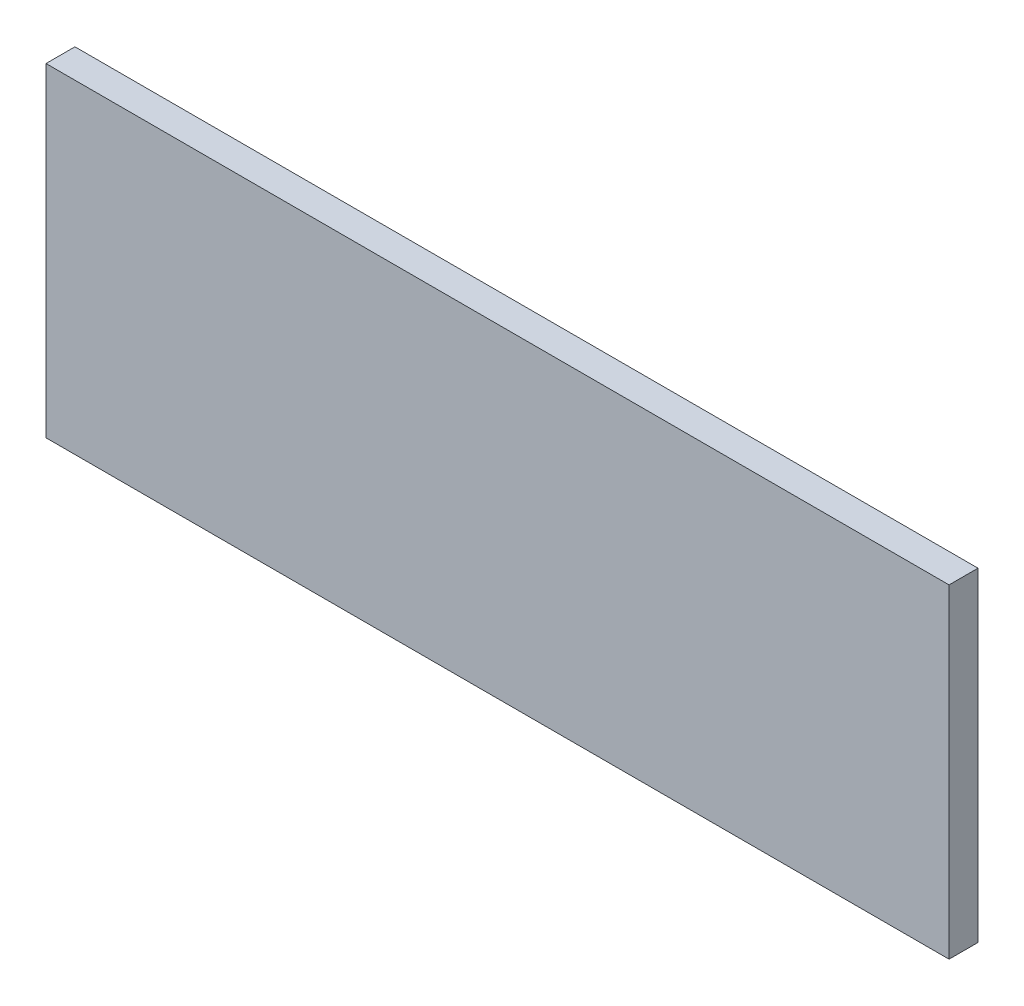
ISO-10303-21;
HEADER;
FILE_DESCRIPTION(('STEP AP214'),'2;1');
FILE_NAME('part.step','',(''),(''),'','','');
FILE_SCHEMA(('AUTOMOTIVE_DESIGN { 1 0 10303 214 1 1 1 1 }'));
ENDSEC;
DATA;
#1=APPLICATION_CONTEXT('core data for automotive mechanical design processes');
#2=APPLICATION_PROTOCOL_DEFINITION('international standard','automotive_design',2000,#1);
#3=PRODUCT_CONTEXT('',#1,'mechanical');
#4=PRODUCT('Part','Part','',(#3));
#5=PRODUCT_RELATED_PRODUCT_CATEGORY('part','',(#4));
#6=PRODUCT_DEFINITION_FORMATION('','',#4);
#7=PRODUCT_DEFINITION_CONTEXT('part definition',#1,'design');
#8=PRODUCT_DEFINITION('design','',#6,#7);
#9=PRODUCT_DEFINITION_SHAPE('','',#8);
#10=(LENGTH_UNIT() NAMED_UNIT(*) SI_UNIT(.MILLI.,.METRE.));
#11=(NAMED_UNIT(*) PLANE_ANGLE_UNIT() SI_UNIT($,.RADIAN.));
#12=(NAMED_UNIT(*) SI_UNIT($,.STERADIAN.) SOLID_ANGLE_UNIT());
#13=UNCERTAINTY_MEASURE_WITH_UNIT(LENGTH_MEASURE(1.E-05),#10,'distance_accuracy_value','');
#14=(GEOMETRIC_REPRESENTATION_CONTEXT(3) GLOBAL_UNCERTAINTY_ASSIGNED_CONTEXT((#13)) GLOBAL_UNIT_ASSIGNED_CONTEXT((#10,
#11,#12)) REPRESENTATION_CONTEXT('',''));
#15=CARTESIAN_POINT('',(0.,0.,0.));
#16=DIRECTION('',(0.,0.,1.));
#17=DIRECTION('',(1.,0.,0.));
#18=AXIS2_PLACEMENT_3D('',#15,#16,#17);
#19=CARTESIAN_POINT('',(-36.1150442477876,16.9218289085546,2.5));
#20=DIRECTION('',(1.,0.,0.));
#21=DIRECTION('',(0.,1.,0.));
#22=AXIS2_PLACEMENT_3D('',#19,#20,#21);
#23=PLANE('',#22);
#24=DIRECTION('',(0.,-1.,0.));
#25=VECTOR('',#24,1.);
#26=CARTESIAN_POINT('',(-36.1150442477876,16.9218289085546,0.));
#27=LINE('',#26,#25);
#28=CARTESIAN_POINT('',(-36.1150442477876,16.9218289085546,0.));
#29=VERTEX_POINT('',#28);
#30=CARTESIAN_POINT('',(-36.1150442477876,-11.0781710914454,0.));
#31=VERTEX_POINT('',#30);
#32=EDGE_CURVE('E96',#29,#31,#27,.T.);
#33=ORIENTED_EDGE('',*,*,#32,.T.);
#34=DIRECTION('',(0.,0.,-1.));
#35=VECTOR('',#34,1.);
#36=CARTESIAN_POINT('',(-36.1150442477876,-11.0781710914454,2.5));
#37=LINE('',#36,#35);
#38=CARTESIAN_POINT('',(-36.1150442477876,-11.0781710914454,2.5));
#39=VERTEX_POINT('',#38);
#40=EDGE_CURVE('E11',#39,#31,#37,.T.);
#41=ORIENTED_EDGE('',*,*,#40,.F.);
#42=DIRECTION('',(0.,-1.,0.));
#43=VECTOR('',#42,1.);
#44=CARTESIAN_POINT('',(-36.1150442477876,16.9218289085546,2.5));
#45=LINE('',#44,#43);
#46=CARTESIAN_POINT('',(-36.1150442477876,16.9218289085546,2.5));
#47=VERTEX_POINT('',#46);
#48=EDGE_CURVE('E84',#47,#39,#45,.T.);
#49=ORIENTED_EDGE('',*,*,#48,.F.);
#50=DIRECTION('',(0.,0.,-1.));
#51=VECTOR('',#50,1.);
#52=CARTESIAN_POINT('',(-36.1150442477876,16.9218289085546,2.5));
#53=LINE('',#52,#51);
#54=EDGE_CURVE('E92',#47,#29,#53,.T.);
#55=ORIENTED_EDGE('',*,*,#54,.T.);
#56=EDGE_LOOP('',(#33,#41,#49,#55));
#57=FACE_BOUND('',#56,.T.);
#58=ADVANCED_FACE('F33',(#57),#23,.F.);
#59=CARTESIAN_POINT('',(41.8849557522124,-11.0781710914454,2.5));
#60=DIRECTION('',(0.,1.,0.));
#61=DIRECTION('',(-1.,0.,0.));
#62=AXIS2_PLACEMENT_3D('',#59,#60,#61);
#63=PLANE('',#62);
#64=DIRECTION('',(1.,0.,0.));
#65=VECTOR('',#64,1.);
#66=CARTESIAN_POINT('',(41.8849557522124,-11.0781710914454,0.));
#67=LINE('',#66,#65);
#68=CARTESIAN_POINT('',(41.8849557522124,-11.0781710914454,0.));
#69=VERTEX_POINT('',#68);
#70=EDGE_CURVE('E88',#31,#69,#67,.T.);
#71=ORIENTED_EDGE('',*,*,#70,.T.);
#72=DIRECTION('',(0.,0.,-1.));
#73=VECTOR('',#72,1.);
#74=CARTESIAN_POINT('',(41.8849557522124,-11.0781710914454,2.5));
#75=LINE('',#74,#73);
#76=CARTESIAN_POINT('',(41.8849557522124,-11.0781710914454,2.5));
#77=VERTEX_POINT('',#76);
#78=EDGE_CURVE('E41',#77,#69,#75,.T.);
#79=ORIENTED_EDGE('',*,*,#78,.F.);
#80=DIRECTION('',(1.,0.,0.));
#81=VECTOR('',#80,1.);
#82=CARTESIAN_POINT('',(41.8849557522124,-11.0781710914454,2.5));
#83=LINE('',#82,#81);
#84=EDGE_CURVE('E79',#39,#77,#83,.T.);
#85=ORIENTED_EDGE('',*,*,#84,.F.);
#86=ORIENTED_EDGE('',*,*,#40,.T.);
#87=EDGE_LOOP('',(#71,#79,#85,#86));
#88=FACE_BOUND('',#87,.T.);
#89=ADVANCED_FACE('F87',(#88),#63,.F.);
#90=CARTESIAN_POINT('',(41.8849557522124,16.9218289085546,2.5));
#91=DIRECTION('',(-1.,0.,0.));
#92=DIRECTION('',(0.,0.,1.));
#93=AXIS2_PLACEMENT_3D('',#90,#91,#92);
#94=PLANE('',#93);
#95=DIRECTION('',(0.,1.,0.));
#96=VECTOR('',#95,1.);
#97=CARTESIAN_POINT('',(41.8849557522124,16.9218289085546,0.));
#98=LINE('',#97,#96);
#99=CARTESIAN_POINT('',(41.8849557522124,16.9218289085546,0.));
#100=VERTEX_POINT('',#99);
#101=EDGE_CURVE('E66',#69,#100,#98,.T.);
#102=ORIENTED_EDGE('',*,*,#101,.T.);
#103=DIRECTION('',(0.,0.,-1.));
#104=VECTOR('',#103,1.);
#105=CARTESIAN_POINT('',(41.8849557522124,16.9218289085546,2.5));
#106=LINE('',#105,#104);
#107=CARTESIAN_POINT('',(41.8849557522124,16.9218289085546,2.5));
#108=VERTEX_POINT('',#107);
#109=EDGE_CURVE('E89',#108,#100,#106,.T.);
#110=ORIENTED_EDGE('',*,*,#109,.F.);
#111=DIRECTION('',(0.,1.,0.));
#112=VECTOR('',#111,1.);
#113=CARTESIAN_POINT('',(41.8849557522124,16.9218289085546,2.5));
#114=LINE('',#113,#112);
#115=EDGE_CURVE('E82',#77,#108,#114,.T.);
#116=ORIENTED_EDGE('',*,*,#115,.F.);
#117=ORIENTED_EDGE('',*,*,#78,.T.);
#118=EDGE_LOOP('',(#102,#110,#116,#117));
#119=FACE_BOUND('',#118,.T.);
#120=ADVANCED_FACE('F90',(#119),#94,.F.);
#121=CARTESIAN_POINT('',(-36.1150442477876,16.9218289085546,2.5));
#122=DIRECTION('',(0.,-1.,0.));
#123=DIRECTION('',(0.,0.,-1.));
#124=AXIS2_PLACEMENT_3D('',#121,#122,#123);
#125=PLANE('',#124);
#126=DIRECTION('',(-1.,0.,0.));
#127=VECTOR('',#126,1.);
#128=CARTESIAN_POINT('',(-36.1150442477876,16.9218289085546,0.));
#129=LINE('',#128,#127);
#130=EDGE_CURVE('E72',#100,#29,#129,.T.);
#131=ORIENTED_EDGE('',*,*,#130,.T.);
#132=ORIENTED_EDGE('',*,*,#54,.F.);
#133=DIRECTION('',(-1.,0.,0.));
#134=VECTOR('',#133,1.);
#135=CARTESIAN_POINT('',(-36.1150442477876,16.9218289085546,2.5));
#136=LINE('',#135,#134);
#137=EDGE_CURVE('E49',#108,#47,#136,.T.);
#138=ORIENTED_EDGE('',*,*,#137,.F.);
#139=ORIENTED_EDGE('',*,*,#109,.T.);
#140=EDGE_LOOP('',(#131,#132,#138,#139));
#141=FACE_BOUND('',#140,.T.);
#142=ADVANCED_FACE('F103',(#141),#125,.F.);
#143=CARTESIAN_POINT('',(0.,0.,2.5));
#144=DIRECTION('',(0.,0.,-1.));
#145=DIRECTION('',(-1.,0.,0.));
#146=AXIS2_PLACEMENT_3D('',#143,#144,#145);
#147=PLANE('',#146);
#148=ORIENTED_EDGE('',*,*,#48,.T.);
#149=ORIENTED_EDGE('',*,*,#84,.T.);
#150=ORIENTED_EDGE('',*,*,#115,.T.);
#151=ORIENTED_EDGE('',*,*,#137,.T.);
#152=EDGE_LOOP('',(#148,#149,#150,#151));
#153=FACE_BOUND('',#152,.T.);
#154=ADVANCED_FACE('F80',(#153),#147,.F.);
#155=CARTESIAN_POINT('',(0.,0.,0.));
#156=DIRECTION('',(0.,0.,-1.));
#157=DIRECTION('',(-1.,0.,0.));
#158=AXIS2_PLACEMENT_3D('',#155,#156,#157);
#159=PLANE('',#158);
#160=ORIENTED_EDGE('',*,*,#32,.F.);
#161=ORIENTED_EDGE('',*,*,#130,.F.);
#162=ORIENTED_EDGE('',*,*,#101,.F.);
#163=ORIENTED_EDGE('',*,*,#70,.F.);
#164=EDGE_LOOP('',(#160,#161,#162,#163));
#165=FACE_BOUND('',#164,.T.);
#166=ADVANCED_FACE('F106',(#165),#159,.T.);
#167=CLOSED_SHELL('',(#58,#89,#120,#142,#154,#166));
#168=MANIFOLD_SOLID_BREP('B2',#167);
#169=ADVANCED_BREP_SHAPE_REPRESENTATION('',(#18,#168),#14);
#170=SHAPE_DEFINITION_REPRESENTATION(#9,#169);
ENDSEC;
END-ISO-10303-21;
